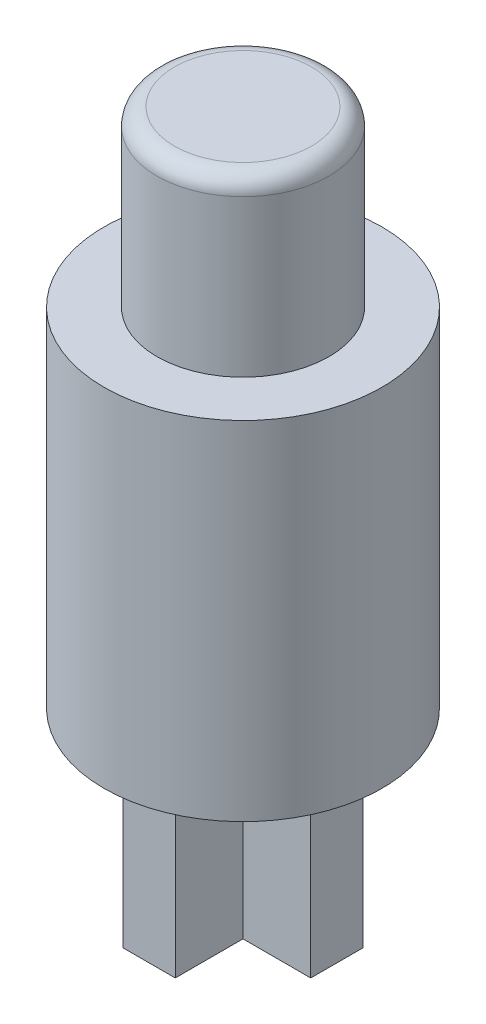
ISO-10303-21;
HEADER;
FILE_DESCRIPTION(('STEP AP214'),'2;1');
FILE_NAME('part.step','',(''),(''),'','','');
FILE_SCHEMA(('AUTOMOTIVE_DESIGN { 1 0 10303 214 1 1 1 1 }'));
ENDSEC;
DATA;
#1=APPLICATION_CONTEXT('core data for automotive mechanical design processes');
#2=APPLICATION_PROTOCOL_DEFINITION('international standard','automotive_design',2000,#1);
#3=PRODUCT_CONTEXT('',#1,'mechanical');
#4=PRODUCT('Part','Part','',(#3));
#5=PRODUCT_RELATED_PRODUCT_CATEGORY('part','',(#4));
#6=PRODUCT_DEFINITION_FORMATION('','',#4);
#7=PRODUCT_DEFINITION_CONTEXT('part definition',#1,'design');
#8=PRODUCT_DEFINITION('design','',#6,#7);
#9=PRODUCT_DEFINITION_SHAPE('','',#8);
#10=(LENGTH_UNIT() NAMED_UNIT(*) SI_UNIT(.MILLI.,.METRE.));
#11=(NAMED_UNIT(*) PLANE_ANGLE_UNIT() SI_UNIT($,.RADIAN.));
#12=(NAMED_UNIT(*) SI_UNIT($,.STERADIAN.) SOLID_ANGLE_UNIT());
#13=UNCERTAINTY_MEASURE_WITH_UNIT(LENGTH_MEASURE(1.E-05),#10,'distance_accuracy_value','');
#14=(GEOMETRIC_REPRESENTATION_CONTEXT(3) GLOBAL_UNCERTAINTY_ASSIGNED_CONTEXT((#13)) GLOBAL_UNIT_ASSIGNED_CONTEXT((#10,
#11,#12)) REPRESENTATION_CONTEXT('',''));
#15=CARTESIAN_POINT('',(0.,0.,0.));
#16=DIRECTION('',(0.,0.,1.));
#17=DIRECTION('',(1.,0.,0.));
#18=AXIS2_PLACEMENT_3D('',#15,#16,#17);
#19=CARTESIAN_POINT('',(0.,-10.,0.));
#20=DIRECTION('',(0.,1.,0.));
#21=DIRECTION('',(0.,0.,1.));
#22=AXIS2_PLACEMENT_3D('',#19,#20,#21);
#23=CYLINDRICAL_SURFACE('',#22,4.);
#24=CARTESIAN_POINT('',(0.,-10.,0.));
#25=DIRECTION('',(0.,1.,0.));
#26=DIRECTION('',(0.,0.,1.));
#27=AXIS2_PLACEMENT_3D('',#24,#25,#26);
#28=CIRCLE('',#27,4.);
#29=CARTESIAN_POINT('',(0.,-10.,4.));
#30=VERTEX_POINT('',#29);
#31=EDGE_CURVE('E173',#30,#30,#28,.T.);
#32=ORIENTED_EDGE('',*,*,#31,.T.);
#33=EDGE_LOOP('',(#32));
#34=FACE_BOUND('',#33,.T.);
#35=CARTESIAN_POINT('',(0.,0.,0.));
#36=DIRECTION('',(0.,1.,0.));
#37=DIRECTION('',(0.,0.,1.));
#38=AXIS2_PLACEMENT_3D('',#35,#36,#37);
#39=CIRCLE('',#38,4.);
#40=CARTESIAN_POINT('',(0.,0.,4.));
#41=VERTEX_POINT('',#40);
#42=EDGE_CURVE('E169',#41,#41,#39,.T.);
#43=ORIENTED_EDGE('',*,*,#42,.F.);
#44=EDGE_LOOP('',(#43));
#45=FACE_BOUND('',#44,.T.);
#46=ADVANCED_FACE('F57',(#34,#45),#23,.T.);
#47=CARTESIAN_POINT('',(0.,-10.,0.));
#48=DIRECTION('',(0.,1.,0.));
#49=DIRECTION('',(0.,0.,1.));
#50=AXIS2_PLACEMENT_3D('',#47,#48,#49);
#51=PLANE('',#50);
#52=DIRECTION('',(1.,0.,0.));
#53=VECTOR('',#52,1.);
#54=CARTESIAN_POINT('',(-0.75,-10.,2.7));
#55=LINE('',#54,#53);
#56=CARTESIAN_POINT('',(-0.75,-10.,2.7));
#57=VERTEX_POINT('',#56);
#58=CARTESIAN_POINT('',(0.75,-10.,2.7));
#59=VERTEX_POINT('',#58);
#60=EDGE_CURVE('E263',#57,#59,#55,.T.);
#61=ORIENTED_EDGE('',*,*,#60,.T.);
#62=DIRECTION('',(0.,0.,-1.));
#63=VECTOR('',#62,1.);
#64=CARTESIAN_POINT('',(0.75,-10.,2.7));
#65=LINE('',#64,#63);
#66=CARTESIAN_POINT('',(0.75,-10.,0.75));
#67=VERTEX_POINT('',#66);
#68=EDGE_CURVE('E72',#59,#67,#65,.T.);
#69=ORIENTED_EDGE('',*,*,#68,.T.);
#70=DIRECTION('',(1.,0.,0.));
#71=VECTOR('',#70,1.);
#72=CARTESIAN_POINT('',(-2.7,-10.,0.75));
#73=LINE('',#72,#71);
#74=CARTESIAN_POINT('',(2.7,-10.,0.75));
#75=VERTEX_POINT('',#74);
#76=EDGE_CURVE('E138',#67,#75,#73,.T.);
#77=ORIENTED_EDGE('',*,*,#76,.T.);
#78=DIRECTION('',(0.,0.,-1.));
#79=VECTOR('',#78,1.);
#80=CARTESIAN_POINT('',(2.7,-10.,0.75));
#81=LINE('',#80,#79);
#82=CARTESIAN_POINT('',(2.7,-10.,-0.75));
#83=VERTEX_POINT('',#82);
#84=EDGE_CURVE('E137',#75,#83,#81,.T.);
#85=ORIENTED_EDGE('',*,*,#84,.T.);
#86=DIRECTION('',(1.,0.,0.));
#87=VECTOR('',#86,1.);
#88=CARTESIAN_POINT('',(-2.7,-10.,-0.75));
#89=LINE('',#88,#87);
#90=CARTESIAN_POINT('',(0.75,-10.,-0.749999999999999));
#91=VERTEX_POINT('',#90);
#92=EDGE_CURVE('E151',#91,#83,#89,.T.);
#93=ORIENTED_EDGE('',*,*,#92,.F.);
#94=CARTESIAN_POINT('',(0.75,-10.,-2.7));
#95=VERTEX_POINT('',#94);
#96=EDGE_CURVE('E275',#91,#95,#65,.T.);
#97=ORIENTED_EDGE('',*,*,#96,.T.);
#98=DIRECTION('',(1.,0.,0.));
#99=VECTOR('',#98,1.);
#100=CARTESIAN_POINT('',(-0.75,-10.,-2.7));
#101=LINE('',#100,#99);
#102=CARTESIAN_POINT('',(-0.75,-10.,-2.7));
#103=VERTEX_POINT('',#102);
#104=EDGE_CURVE('E272',#103,#95,#101,.T.);
#105=ORIENTED_EDGE('',*,*,#104,.F.);
#106=DIRECTION('',(0.,0.,-1.));
#107=VECTOR('',#106,1.);
#108=CARTESIAN_POINT('',(-0.75,-10.,2.7));
#109=LINE('',#108,#107);
#110=CARTESIAN_POINT('',(-0.75,-10.,-0.749999999999999));
#111=VERTEX_POINT('',#110);
#112=EDGE_CURVE('E124',#111,#103,#109,.T.);
#113=ORIENTED_EDGE('',*,*,#112,.F.);
#114=CARTESIAN_POINT('',(-2.7,-10.,-0.75));
#115=VERTEX_POINT('',#114);
#116=EDGE_CURVE('E146',#115,#111,#89,.T.);
#117=ORIENTED_EDGE('',*,*,#116,.F.);
#118=DIRECTION('',(0.,0.,-1.));
#119=VECTOR('',#118,1.);
#120=CARTESIAN_POINT('',(-2.7,-10.,0.75));
#121=LINE('',#120,#119);
#122=CARTESIAN_POINT('',(-2.7,-10.,0.75));
#123=VERTEX_POINT('',#122);
#124=EDGE_CURVE('E118',#123,#115,#121,.T.);
#125=ORIENTED_EDGE('',*,*,#124,.F.);
#126=CARTESIAN_POINT('',(-0.75,-10.,0.75));
#127=VERTEX_POINT('',#126);
#128=EDGE_CURVE('E129',#123,#127,#73,.T.);
#129=ORIENTED_EDGE('',*,*,#128,.T.);
#130=EDGE_CURVE('E270',#57,#127,#109,.T.);
#131=ORIENTED_EDGE('',*,*,#130,.F.);
#132=EDGE_LOOP('',(#61,#69,#77,#85,#93,#97,#105,#113,#117,#125,#129,#131));
#133=FACE_BOUND('',#132,.T.);
#134=ORIENTED_EDGE('',*,*,#31,.F.);
#135=EDGE_LOOP('',(#134));
#136=FACE_BOUND('',#135,.T.);
#137=ADVANCED_FACE('F142',(#133,#136),#51,.F.);
#138=CARTESIAN_POINT('',(0.,0.,0.));
#139=DIRECTION('',(0.,1.,0.));
#140=DIRECTION('',(0.,0.,1.));
#141=AXIS2_PLACEMENT_3D('',#138,#139,#140);
#142=PLANE('',#141);
#143=CARTESIAN_POINT('',(0.,0.,0.));
#144=DIRECTION('',(0.,1.,0.));
#145=DIRECTION('',(0.,0.,1.));
#146=AXIS2_PLACEMENT_3D('',#143,#144,#145);
#147=CIRCLE('',#146,2.475);
#148=CARTESIAN_POINT('',(0.,0.,2.475));
#149=VERTEX_POINT('',#148);
#150=EDGE_CURVE('E170',#149,#149,#147,.T.);
#151=ORIENTED_EDGE('',*,*,#150,.F.);
#152=EDGE_LOOP('',(#151));
#153=FACE_BOUND('',#152,.T.);
#154=ORIENTED_EDGE('',*,*,#42,.T.);
#155=EDGE_LOOP('',(#154));
#156=FACE_BOUND('',#155,.T.);
#157=ADVANCED_FACE('F199',(#153,#156),#142,.T.);
#158=CARTESIAN_POINT('',(0.,5.,0.));
#159=DIRECTION('',(0.,-1.,0.));
#160=DIRECTION('',(0.,0.,-1.));
#161=AXIS2_PLACEMENT_3D('',#158,#159,#160);
#162=CYLINDRICAL_SURFACE('',#161,2.475);
#163=CARTESIAN_POINT('',(0.,4.5,0.));
#164=DIRECTION('',(0.,1.,0.));
#165=DIRECTION('',(0.,0.,1.));
#166=AXIS2_PLACEMENT_3D('',#163,#164,#165);
#167=CIRCLE('',#166,2.475);
#168=CARTESIAN_POINT('',(0.,4.5,2.475));
#169=VERTEX_POINT('',#168);
#170=EDGE_CURVE('E12',#169,#169,#167,.F.);
#171=ORIENTED_EDGE('',*,*,#170,.T.);
#172=EDGE_LOOP('',(#171));
#173=FACE_BOUND('',#172,.T.);
#174=ORIENTED_EDGE('',*,*,#150,.T.);
#175=EDGE_LOOP('',(#174));
#176=FACE_BOUND('',#175,.T.);
#177=ADVANCED_FACE('F204',(#173,#176),#162,.T.);
#178=CARTESIAN_POINT('',(0.,5.,0.));
#179=DIRECTION('',(0.,1.,0.));
#180=DIRECTION('',(0.,0.,1.));
#181=AXIS2_PLACEMENT_3D('',#178,#179,#180);
#182=PLANE('',#181);
#183=CARTESIAN_POINT('',(0.,5.,0.));
#184=DIRECTION('',(0.,1.,0.));
#185=DIRECTION('',(0.,0.,1.));
#186=AXIS2_PLACEMENT_3D('',#183,#184,#185);
#187=CIRCLE('',#186,1.975);
#188=CARTESIAN_POINT('',(0.,5.,1.975));
#189=VERTEX_POINT('',#188);
#190=EDGE_CURVE('E65',#189,#189,#187,.T.);
#191=ORIENTED_EDGE('',*,*,#190,.T.);
#192=EDGE_LOOP('',(#191));
#193=FACE_BOUND('',#192,.T.);
#194=ADVANCED_FACE('F180',(#193),#182,.T.);
#195=CARTESIAN_POINT('',(-0.75,-15.,2.7));
#196=DIRECTION('',(1.,0.,0.));
#197=DIRECTION('',(0.,0.,-1.));
#198=AXIS2_PLACEMENT_3D('',#195,#196,#197);
#199=PLANE('',#198);
#200=DIRECTION('',(0.,-1.,0.));
#201=VECTOR('',#200,1.);
#202=CARTESIAN_POINT('',(-0.75,-15.,-0.75));
#203=LINE('',#202,#201);
#204=CARTESIAN_POINT('',(-0.75,-15.,-0.749999999999999));
#205=VERTEX_POINT('',#204);
#206=EDGE_CURVE('E164',#111,#205,#203,.T.);
#207=ORIENTED_EDGE('',*,*,#206,.F.);
#208=ORIENTED_EDGE('',*,*,#112,.T.);
#209=DIRECTION('',(0.,1.,0.));
#210=VECTOR('',#209,1.);
#211=CARTESIAN_POINT('',(-0.75,-15.,-2.7));
#212=LINE('',#211,#210);
#213=CARTESIAN_POINT('',(-0.75,-15.,-2.7));
#214=VERTEX_POINT('',#213);
#215=EDGE_CURVE('E163',#214,#103,#212,.T.);
#216=ORIENTED_EDGE('',*,*,#215,.F.);
#217=DIRECTION('',(0.,0.,-1.));
#218=VECTOR('',#217,1.);
#219=CARTESIAN_POINT('',(-0.75,-15.,2.7));
#220=LINE('',#219,#218);
#221=EDGE_CURVE('E257',#205,#214,#220,.T.);
#222=ORIENTED_EDGE('',*,*,#221,.F.);
#223=EDGE_LOOP('',(#207,#208,#216,#222));
#224=FACE_BOUND('',#223,.T.);
#225=ADVANCED_FACE('F212',(#224),#199,.F.);
#226=CARTESIAN_POINT('',(-0.75,-15.,-2.7));
#227=DIRECTION('',(0.,0.,1.));
#228=DIRECTION('',(1.,0.,0.));
#229=AXIS2_PLACEMENT_3D('',#226,#227,#228);
#230=PLANE('',#229);
#231=ORIENTED_EDGE('',*,*,#104,.T.);
#232=DIRECTION('',(0.,1.,0.));
#233=VECTOR('',#232,1.);
#234=CARTESIAN_POINT('',(0.75,-15.,-2.7));
#235=LINE('',#234,#233);
#236=CARTESIAN_POINT('',(0.75,-15.,-2.7));
#237=VERTEX_POINT('',#236);
#238=EDGE_CURVE('E281',#237,#95,#235,.T.);
#239=ORIENTED_EDGE('',*,*,#238,.F.);
#240=DIRECTION('',(1.,0.,0.));
#241=VECTOR('',#240,1.);
#242=CARTESIAN_POINT('',(-0.75,-15.,-2.7));
#243=LINE('',#242,#241);
#244=EDGE_CURVE('E256',#214,#237,#243,.T.);
#245=ORIENTED_EDGE('',*,*,#244,.F.);
#246=ORIENTED_EDGE('',*,*,#215,.T.);
#247=EDGE_LOOP('',(#231,#239,#245,#246));
#248=FACE_BOUND('',#247,.T.);
#249=ADVANCED_FACE('F230',(#248),#230,.F.);
#250=CARTESIAN_POINT('',(0.75,-15.,2.7));
#251=DIRECTION('',(1.,0.,0.));
#252=DIRECTION('',(0.,0.,-1.));
#253=AXIS2_PLACEMENT_3D('',#250,#251,#252);
#254=PLANE('',#253);
#255=ORIENTED_EDGE('',*,*,#96,.F.);
#256=DIRECTION('',(0.,-1.,0.));
#257=VECTOR('',#256,1.);
#258=CARTESIAN_POINT('',(0.75,-15.,-0.75));
#259=LINE('',#258,#257);
#260=CARTESIAN_POINT('',(0.75,-15.,-0.749999999999999));
#261=VERTEX_POINT('',#260);
#262=EDGE_CURVE('E81',#91,#261,#259,.T.);
#263=ORIENTED_EDGE('',*,*,#262,.T.);
#264=DIRECTION('',(0.,0.,-1.));
#265=VECTOR('',#264,1.);
#266=CARTESIAN_POINT('',(0.75,-15.,2.7));
#267=LINE('',#266,#265);
#268=EDGE_CURVE('E260',#261,#237,#267,.T.);
#269=ORIENTED_EDGE('',*,*,#268,.T.);
#270=ORIENTED_EDGE('',*,*,#238,.T.);
#271=EDGE_LOOP('',(#255,#263,#269,#270));
#272=FACE_BOUND('',#271,.T.);
#273=ADVANCED_FACE('F233',(#272),#254,.T.);
#274=CARTESIAN_POINT('',(-0.75,-15.,2.7));
#275=DIRECTION('',(0.,0.,1.));
#276=DIRECTION('',(1.,0.,0.));
#277=AXIS2_PLACEMENT_3D('',#274,#275,#276);
#278=PLANE('',#277);
#279=ORIENTED_EDGE('',*,*,#60,.F.);
#280=DIRECTION('',(0.,1.,0.));
#281=VECTOR('',#280,1.);
#282=CARTESIAN_POINT('',(-0.75,-15.,2.7));
#283=LINE('',#282,#281);
#284=CARTESIAN_POINT('',(-0.75,-15.,2.7));
#285=VERTEX_POINT('',#284);
#286=EDGE_CURVE('E269',#285,#57,#283,.T.);
#287=ORIENTED_EDGE('',*,*,#286,.F.);
#288=DIRECTION('',(1.,0.,0.));
#289=VECTOR('',#288,1.);
#290=CARTESIAN_POINT('',(-0.75,-15.,2.7));
#291=LINE('',#290,#289);
#292=CARTESIAN_POINT('',(0.75,-15.,2.7));
#293=VERTEX_POINT('',#292);
#294=EDGE_CURVE('E252',#285,#293,#291,.T.);
#295=ORIENTED_EDGE('',*,*,#294,.T.);
#296=DIRECTION('',(0.,1.,0.));
#297=VECTOR('',#296,1.);
#298=CARTESIAN_POINT('',(0.75,-15.,2.7));
#299=LINE('',#298,#297);
#300=EDGE_CURVE('E279',#293,#59,#299,.T.);
#301=ORIENTED_EDGE('',*,*,#300,.T.);
#302=EDGE_LOOP('',(#279,#287,#295,#301));
#303=FACE_BOUND('',#302,.T.);
#304=ADVANCED_FACE('F228',(#303),#278,.T.);
#305=ORIENTED_EDGE('',*,*,#130,.T.);
#306=DIRECTION('',(0.,-1.,0.));
#307=VECTOR('',#306,1.);
#308=CARTESIAN_POINT('',(-0.75,-15.,0.75));
#309=LINE('',#308,#307);
#310=CARTESIAN_POINT('',(-0.75,-15.,0.75));
#311=VERTEX_POINT('',#310);
#312=EDGE_CURVE('E133',#127,#311,#309,.T.);
#313=ORIENTED_EDGE('',*,*,#312,.T.);
#314=EDGE_CURVE('E248',#285,#311,#220,.T.);
#315=ORIENTED_EDGE('',*,*,#314,.F.);
#316=ORIENTED_EDGE('',*,*,#286,.T.);
#317=EDGE_LOOP('',(#305,#313,#315,#316));
#318=FACE_BOUND('',#317,.T.);
#319=ADVANCED_FACE('F224',(#318),#199,.F.);
#320=DIRECTION('',(0.,-1.,0.));
#321=VECTOR('',#320,1.);
#322=CARTESIAN_POINT('',(0.75,-15.,0.75));
#323=LINE('',#322,#321);
#324=CARTESIAN_POINT('',(0.75,-15.,0.75));
#325=VERTEX_POINT('',#324);
#326=EDGE_CURVE('E162',#67,#325,#323,.T.);
#327=ORIENTED_EDGE('',*,*,#326,.F.);
#328=ORIENTED_EDGE('',*,*,#68,.F.);
#329=ORIENTED_EDGE('',*,*,#300,.F.);
#330=EDGE_CURVE('E265',#293,#325,#267,.T.);
#331=ORIENTED_EDGE('',*,*,#330,.T.);
#332=EDGE_LOOP('',(#327,#328,#329,#331));
#333=FACE_BOUND('',#332,.T.);
#334=ADVANCED_FACE('F227',(#333),#254,.T.);
#335=CARTESIAN_POINT('',(0.,-15.,0.));
#336=DIRECTION('',(0.,-1.,0.));
#337=DIRECTION('',(0.,0.,-1.));
#338=AXIS2_PLACEMENT_3D('',#335,#336,#337);
#339=PLANE('',#338);
#340=ORIENTED_EDGE('',*,*,#314,.T.);
#341=DIRECTION('',(1.,0.,0.));
#342=VECTOR('',#341,1.);
#343=CARTESIAN_POINT('',(-2.7,-15.,0.75));
#344=LINE('',#343,#342);
#345=CARTESIAN_POINT('',(-2.7,-15.,0.75));
#346=VERTEX_POINT('',#345);
#347=EDGE_CURVE('E149',#346,#311,#344,.T.);
#348=ORIENTED_EDGE('',*,*,#347,.F.);
#349=DIRECTION('',(0.,0.,-1.));
#350=VECTOR('',#349,1.);
#351=CARTESIAN_POINT('',(-2.7,-15.,0.75));
#352=LINE('',#351,#350);
#353=CARTESIAN_POINT('',(-2.7,-15.,-0.75));
#354=VERTEX_POINT('',#353);
#355=EDGE_CURVE('E120',#346,#354,#352,.T.);
#356=ORIENTED_EDGE('',*,*,#355,.T.);
#357=DIRECTION('',(1.,0.,0.));
#358=VECTOR('',#357,1.);
#359=CARTESIAN_POINT('',(-2.7,-15.,-0.75));
#360=LINE('',#359,#358);
#361=EDGE_CURVE('E290',#354,#205,#360,.T.);
#362=ORIENTED_EDGE('',*,*,#361,.T.);
#363=ORIENTED_EDGE('',*,*,#221,.T.);
#364=ORIENTED_EDGE('',*,*,#244,.T.);
#365=ORIENTED_EDGE('',*,*,#268,.F.);
#366=CARTESIAN_POINT('',(2.7,-15.,-0.75));
#367=VERTEX_POINT('',#366);
#368=EDGE_CURVE('E289',#261,#367,#360,.T.);
#369=ORIENTED_EDGE('',*,*,#368,.T.);
#370=DIRECTION('',(0.,0.,-1.));
#371=VECTOR('',#370,1.);
#372=CARTESIAN_POINT('',(2.7,-15.,0.75));
#373=LINE('',#372,#371);
#374=CARTESIAN_POINT('',(2.7,-15.,0.75));
#375=VERTEX_POINT('',#374);
#376=EDGE_CURVE('E286',#375,#367,#373,.T.);
#377=ORIENTED_EDGE('',*,*,#376,.F.);
#378=EDGE_CURVE('E147',#325,#375,#344,.T.);
#379=ORIENTED_EDGE('',*,*,#378,.F.);
#380=ORIENTED_EDGE('',*,*,#330,.F.);
#381=ORIENTED_EDGE('',*,*,#294,.F.);
#382=EDGE_LOOP('',(#340,#348,#356,#362,#363,#364,#365,#369,#377,#379,#380,#381));
#383=FACE_BOUND('',#382,.T.);
#384=ADVANCED_FACE('F219',(#383),#339,.T.);
#385=CARTESIAN_POINT('',(2.7,-15.,0.75));
#386=DIRECTION('',(1.,0.,0.));
#387=DIRECTION('',(0.,0.,-1.));
#388=AXIS2_PLACEMENT_3D('',#385,#386,#387);
#389=PLANE('',#388);
#390=ORIENTED_EDGE('',*,*,#84,.F.);
#391=DIRECTION('',(0.,1.,0.));
#392=VECTOR('',#391,1.);
#393=CARTESIAN_POINT('',(2.7,-15.,0.75));
#394=LINE('',#393,#392);
#395=EDGE_CURVE('E159',#375,#75,#394,.T.);
#396=ORIENTED_EDGE('',*,*,#395,.F.);
#397=ORIENTED_EDGE('',*,*,#376,.T.);
#398=DIRECTION('',(0.,1.,0.));
#399=VECTOR('',#398,1.);
#400=CARTESIAN_POINT('',(2.7,-15.,-0.75));
#401=LINE('',#400,#399);
#402=EDGE_CURVE('E156',#367,#83,#401,.T.);
#403=ORIENTED_EDGE('',*,*,#402,.T.);
#404=EDGE_LOOP('',(#390,#396,#397,#403));
#405=FACE_BOUND('',#404,.T.);
#406=ADVANCED_FACE('F216',(#405),#389,.T.);
#407=CARTESIAN_POINT('',(-2.7,-15.,0.75));
#408=DIRECTION('',(0.,0.,1.));
#409=DIRECTION('',(1.,0.,0.));
#410=AXIS2_PLACEMENT_3D('',#407,#408,#409);
#411=PLANE('',#410);
#412=ORIENTED_EDGE('',*,*,#76,.F.);
#413=ORIENTED_EDGE('',*,*,#326,.T.);
#414=ORIENTED_EDGE('',*,*,#378,.T.);
#415=ORIENTED_EDGE('',*,*,#395,.T.);
#416=EDGE_LOOP('',(#412,#413,#414,#415));
#417=FACE_BOUND('',#416,.T.);
#418=ADVANCED_FACE('F213',(#417),#411,.T.);
#419=CARTESIAN_POINT('',(-2.7,-15.,-0.75));
#420=DIRECTION('',(0.,0.,1.));
#421=DIRECTION('',(1.,0.,0.));
#422=AXIS2_PLACEMENT_3D('',#419,#420,#421);
#423=PLANE('',#422);
#424=ORIENTED_EDGE('',*,*,#262,.F.);
#425=ORIENTED_EDGE('',*,*,#92,.T.);
#426=ORIENTED_EDGE('',*,*,#402,.F.);
#427=ORIENTED_EDGE('',*,*,#368,.F.);
#428=EDGE_LOOP('',(#424,#425,#426,#427));
#429=FACE_BOUND('',#428,.T.);
#430=ADVANCED_FACE('F190',(#429),#423,.F.);
#431=ORIENTED_EDGE('',*,*,#312,.F.);
#432=ORIENTED_EDGE('',*,*,#128,.F.);
#433=DIRECTION('',(0.,1.,0.));
#434=VECTOR('',#433,1.);
#435=CARTESIAN_POINT('',(-2.7,-15.,0.75));
#436=LINE('',#435,#434);
#437=EDGE_CURVE('E113',#346,#123,#436,.T.);
#438=ORIENTED_EDGE('',*,*,#437,.F.);
#439=ORIENTED_EDGE('',*,*,#347,.T.);
#440=EDGE_LOOP('',(#431,#432,#438,#439));
#441=FACE_BOUND('',#440,.T.);
#442=ADVANCED_FACE('F130',(#441),#411,.T.);
#443=CARTESIAN_POINT('',(-2.7,-15.,0.75));
#444=DIRECTION('',(1.,0.,0.));
#445=DIRECTION('',(0.,0.,-1.));
#446=AXIS2_PLACEMENT_3D('',#443,#444,#445);
#447=PLANE('',#446);
#448=ORIENTED_EDGE('',*,*,#124,.T.);
#449=DIRECTION('',(0.,1.,0.));
#450=VECTOR('',#449,1.);
#451=CARTESIAN_POINT('',(-2.7,-15.,-0.75));
#452=LINE('',#451,#450);
#453=EDGE_CURVE('E125',#354,#115,#452,.T.);
#454=ORIENTED_EDGE('',*,*,#453,.F.);
#455=ORIENTED_EDGE('',*,*,#355,.F.);
#456=ORIENTED_EDGE('',*,*,#437,.T.);
#457=EDGE_LOOP('',(#448,#454,#455,#456));
#458=FACE_BOUND('',#457,.T.);
#459=ADVANCED_FACE('F115',(#458),#447,.F.);
#460=ORIENTED_EDGE('',*,*,#116,.T.);
#461=ORIENTED_EDGE('',*,*,#206,.T.);
#462=ORIENTED_EDGE('',*,*,#361,.F.);
#463=ORIENTED_EDGE('',*,*,#453,.T.);
#464=EDGE_LOOP('',(#460,#461,#462,#463));
#465=FACE_BOUND('',#464,.T.);
#466=ADVANCED_FACE('F183',(#465),#423,.F.);
#467=CARTESIAN_POINT('',(0.,4.5,0.));
#468=DIRECTION('',(0.,1.,0.));
#469=DIRECTION('',(0.,0.,1.));
#470=AXIS2_PLACEMENT_3D('',#467,#468,#469);
#471=TOROIDAL_SURFACE('',#470,1.975,0.5);
#472=ORIENTED_EDGE('',*,*,#170,.F.);
#473=EDGE_LOOP('',(#472));
#474=FACE_BOUND('',#473,.T.);
#475=ORIENTED_EDGE('',*,*,#190,.F.);
#476=EDGE_LOOP('',(#475));
#477=FACE_BOUND('',#476,.T.);
#478=ADVANCED_FACE('F59',(#474,#477),#471,.T.);
#479=CLOSED_SHELL('',(#46,#137,#157,#177,#194,#225,#249,#273,#304,#319,#334,#384,#406,#418,#430,
#442,#459,#466,#478));
#480=MANIFOLD_SOLID_BREP('B2',#479);
#481=ADVANCED_BREP_SHAPE_REPRESENTATION('',(#18,#480),#14);
#482=SHAPE_DEFINITION_REPRESENTATION(#9,#481);
ENDSEC;
END-ISO-10303-21;
